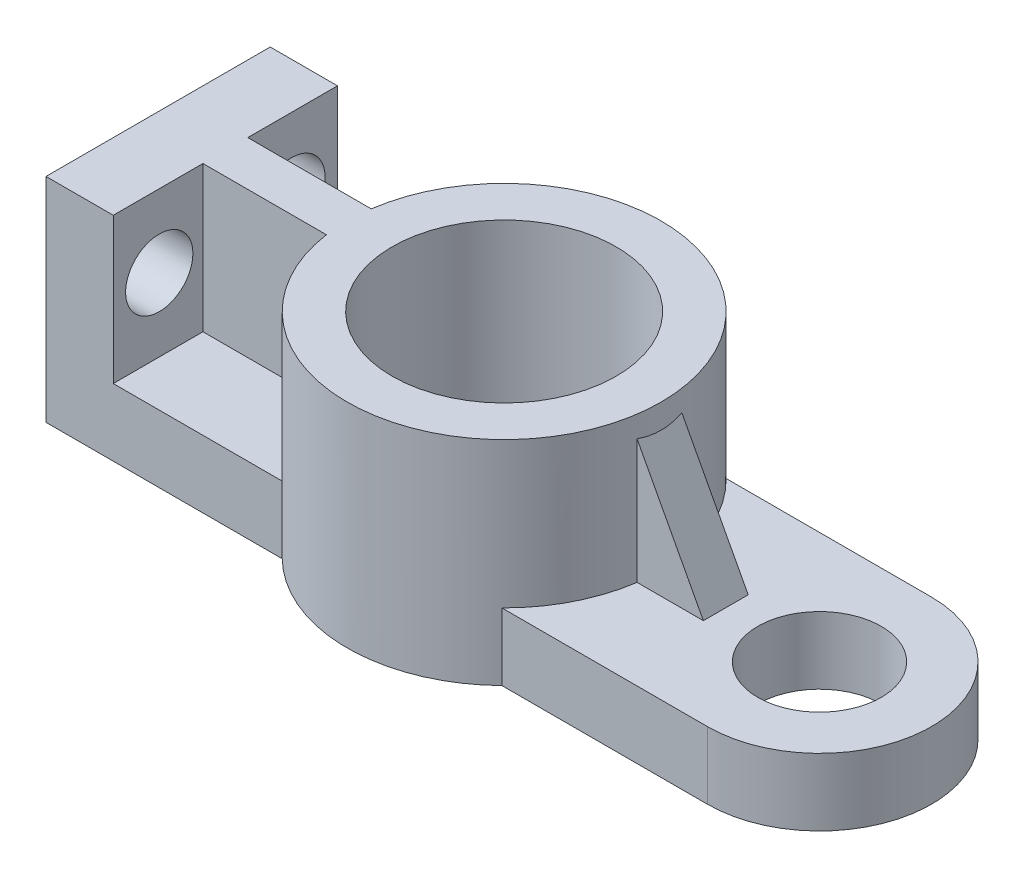
ISO-10303-21;
HEADER;
FILE_DESCRIPTION(('STEP AP214'),'2;1');
FILE_NAME('part.step','',(''),(''),'','','');
FILE_SCHEMA(('AUTOMOTIVE_DESIGN { 1 0 10303 214 1 1 1 1 }'));
ENDSEC;
DATA;
#1=APPLICATION_CONTEXT('core data for automotive mechanical design processes');
#2=APPLICATION_PROTOCOL_DEFINITION('international standard','automotive_design',2000,#1);
#3=PRODUCT_CONTEXT('',#1,'mechanical');
#4=PRODUCT('Part','Part','',(#3));
#5=PRODUCT_RELATED_PRODUCT_CATEGORY('part','',(#4));
#6=PRODUCT_DEFINITION_FORMATION('','',#4);
#7=PRODUCT_DEFINITION_CONTEXT('part definition',#1,'design');
#8=PRODUCT_DEFINITION('design','',#6,#7);
#9=PRODUCT_DEFINITION_SHAPE('','',#8);
#10=(LENGTH_UNIT() NAMED_UNIT(*) SI_UNIT(.MILLI.,.METRE.));
#11=(NAMED_UNIT(*) PLANE_ANGLE_UNIT() SI_UNIT($,.RADIAN.));
#12=(NAMED_UNIT(*) SI_UNIT($,.STERADIAN.) SOLID_ANGLE_UNIT());
#13=UNCERTAINTY_MEASURE_WITH_UNIT(LENGTH_MEASURE(1.E-05),#10,'distance_accuracy_value','');
#14=(GEOMETRIC_REPRESENTATION_CONTEXT(3) GLOBAL_UNCERTAINTY_ASSIGNED_CONTEXT((#13)) GLOBAL_UNIT_ASSIGNED_CONTEXT((#10,
#11,#12)) REPRESENTATION_CONTEXT('',''));
#15=CARTESIAN_POINT('',(0.,0.,0.));
#16=DIRECTION('',(0.,0.,1.));
#17=DIRECTION('',(1.,0.,0.));
#18=AXIS2_PLACEMENT_3D('',#15,#16,#17);
#19=CARTESIAN_POINT('',(0.,15.,100.));
#20=DIRECTION('',(0.,1.,0.));
#21=DIRECTION('',(0.,0.,1.));
#22=AXIS2_PLACEMENT_3D('',#19,#20,#21);
#23=PLANE('',#22);
#24=DIRECTION('',(0.,0.,-1.));
#25=VECTOR('',#24,1.);
#26=CARTESIAN_POINT('',(15.,15.,100.));
#27=LINE('',#26,#25);
#28=CARTESIAN_POINT('',(15.,15.,40.));
#29=VERTEX_POINT('',#28);
#30=CARTESIAN_POINT('',(15.,15.,0.));
#31=VERTEX_POINT('',#30);
#32=EDGE_CURVE('E342',#29,#31,#27,.T.);
#33=ORIENTED_EDGE('',*,*,#32,.F.);
#34=DIRECTION('',(1.,0.,0.));
#35=VECTOR('',#34,1.);
#36=CARTESIAN_POINT('',(0.,15.,40.));
#37=LINE('',#36,#35);
#38=CARTESIAN_POINT('',(70.0606311370799,15.,40.));
#39=VERTEX_POINT('',#38);
#40=EDGE_CURVE('E208',#29,#39,#37,.T.);
#41=ORIENTED_EDGE('',*,*,#40,.T.);
#42=CARTESIAN_POINT('',(139.342663439835,15.,50.));
#43=DIRECTION('',(0.,1.,0.));
#44=DIRECTION('',(0.,0.,1.));
#45=AXIS2_PLACEMENT_3D('',#42,#43,#44);
#46=CIRCLE('',#45,70.);
#47=CARTESIAN_POINT('',(90.3528685841714,15.,0.));
#48=VERTEX_POINT('',#47);
#49=EDGE_CURVE('E260',#48,#39,#46,.T.);
#50=ORIENTED_EDGE('',*,*,#49,.F.);
#51=DIRECTION('',(1.,0.,0.));
#52=VECTOR('',#51,1.);
#53=CARTESIAN_POINT('',(0.,15.,0.));
#54=LINE('',#53,#52);
#55=EDGE_CURVE('E316',#31,#48,#54,.T.);
#56=ORIENTED_EDGE('',*,*,#55,.F.);
#57=EDGE_LOOP('',(#33,#41,#50,#56));
#58=FACE_BOUND('',#57,.T.);
#59=ADVANCED_FACE('F45',(#58),#23,.T.);
#60=CARTESIAN_POINT('',(15.,80.,100.));
#61=DIRECTION('',(1.,0.,0.));
#62=DIRECTION('',(0.,0.,-1.));
#63=AXIS2_PLACEMENT_3D('',#60,#61,#62);
#64=PLANE('',#63);
#65=CARTESIAN_POINT('',(15.,47.5,20.5122660891121));
#66=DIRECTION('',(1.,0.,0.));
#67=DIRECTION('',(0.,0.,1.));
#68=AXIS2_PLACEMENT_3D('',#65,#66,#67);
#69=CIRCLE('',#68,15.);
#70=CARTESIAN_POINT('',(15.,47.5,35.5122660891121));
#71=VERTEX_POINT('',#70);
#72=EDGE_CURVE('E236',#71,#71,#69,.T.);
#73=ORIENTED_EDGE('',*,*,#72,.F.);
#74=EDGE_LOOP('',(#73));
#75=FACE_BOUND('',#74,.T.);
#76=DIRECTION('',(0.,0.,-1.));
#77=VECTOR('',#76,1.);
#78=CARTESIAN_POINT('',(15.,80.,100.));
#79=LINE('',#78,#77);
#80=CARTESIAN_POINT('',(15.,80.,40.));
#81=VERTEX_POINT('',#80);
#82=CARTESIAN_POINT('',(15.,80.,0.));
#83=VERTEX_POINT('',#82);
#84=EDGE_CURVE('E337',#81,#83,#79,.T.);
#85=ORIENTED_EDGE('',*,*,#84,.F.);
#86=DIRECTION('',(0.,-1.,0.));
#87=VECTOR('',#86,1.);
#88=CARTESIAN_POINT('',(15.,80.,40.));
#89=LINE('',#88,#87);
#90=EDGE_CURVE('E212',#81,#29,#89,.T.);
#91=ORIENTED_EDGE('',*,*,#90,.T.);
#92=ORIENTED_EDGE('',*,*,#32,.T.);
#93=DIRECTION('',(0.,1.,0.));
#94=VECTOR('',#93,1.);
#95=CARTESIAN_POINT('',(15.,80.,0.));
#96=LINE('',#95,#94);
#97=EDGE_CURVE('E320',#83,#31,#96,.F.);
#98=ORIENTED_EDGE('',*,*,#97,.F.);
#99=EDGE_LOOP('',(#85,#91,#92,#98));
#100=FACE_BOUND('',#99,.T.);
#101=ADVANCED_FACE('F369',(#75,#100),#64,.T.);
#102=DIRECTION('',(1.,0.,0.));
#103=VECTOR('',#102,1.);
#104=CARTESIAN_POINT('',(0.,15.,60.));
#105=LINE('',#104,#103);
#106=CARTESIAN_POINT('',(208.62469574259,15.,60.));
#107=VERTEX_POINT('',#106);
#108=CARTESIAN_POINT('',(238.197765894712,15.,60.));
#109=VERTEX_POINT('',#108);
#110=EDGE_CURVE('E189',#107,#109,#105,.T.);
#111=ORIENTED_EDGE('',*,*,#110,.F.);
#112=CARTESIAN_POINT('',(188.332458295499,15.,100.));
#113=VERTEX_POINT('',#112);
#114=EDGE_CURVE('E185',#113,#107,#46,.T.);
#115=ORIENTED_EDGE('',*,*,#114,.F.);
#116=DIRECTION('',(1.,0.,0.));
#117=VECTOR('',#116,1.);
#118=CARTESIAN_POINT('',(0.,15.,100.));
#119=LINE('',#118,#117);
#120=CARTESIAN_POINT('',(280.,15.,100.));
#121=VERTEX_POINT('',#120);
#122=EDGE_CURVE('E290',#113,#121,#119,.T.);
#123=ORIENTED_EDGE('',*,*,#122,.T.);
#124=CARTESIAN_POINT('',(280.,15.,50.));
#125=DIRECTION('',(0.,-1.,0.));
#126=DIRECTION('',(0.,0.,-1.));
#127=AXIS2_PLACEMENT_3D('',#124,#125,#126);
#128=CIRCLE('',#127,50.);
#129=CARTESIAN_POINT('',(280.,15.,0.));
#130=VERTEX_POINT('',#129);
#131=EDGE_CURVE('E274',#130,#121,#128,.T.);
#132=ORIENTED_EDGE('',*,*,#131,.F.);
#133=CARTESIAN_POINT('',(188.332458295499,15.,0.));
#134=VERTEX_POINT('',#133);
#135=EDGE_CURVE('E315',#134,#130,#54,.T.);
#136=ORIENTED_EDGE('',*,*,#135,.F.);
#137=CARTESIAN_POINT('',(208.62469574259,15.,40.));
#138=VERTEX_POINT('',#137);
#139=EDGE_CURVE('E259',#138,#134,#46,.T.);
#140=ORIENTED_EDGE('',*,*,#139,.F.);
#141=DIRECTION('',(1.,0.,0.));
#142=VECTOR('',#141,1.);
#143=CARTESIAN_POINT('',(0.,15.,40.));
#144=LINE('',#143,#142);
#145=CARTESIAN_POINT('',(238.197765894712,15.,40.));
#146=VERTEX_POINT('',#145);
#147=EDGE_CURVE('E61',#138,#146,#144,.T.);
#148=ORIENTED_EDGE('',*,*,#147,.T.);
#149=DIRECTION('',(0.,0.,1.));
#150=VECTOR('',#149,1.);
#151=CARTESIAN_POINT('',(238.197765894712,15.,100.));
#152=LINE('',#151,#150);
#153=EDGE_CURVE('E177',#109,#146,#152,.F.);
#154=ORIENTED_EDGE('',*,*,#153,.F.);
#155=EDGE_LOOP('',(#111,#115,#123,#132,#136,#140,#148,#154));
#156=FACE_BOUND('',#155,.T.);
#157=CARTESIAN_POINT('',(280.,15.,50.));
#158=DIRECTION('',(0.,1.,0.));
#159=DIRECTION('',(0.,0.,1.));
#160=AXIS2_PLACEMENT_3D('',#157,#158,#159);
#161=CIRCLE('',#160,27.5);
#162=CARTESIAN_POINT('',(280.,15.,77.5));
#163=VERTEX_POINT('',#162);
#164=EDGE_CURVE('E273',#163,#163,#161,.T.);
#165=ORIENTED_EDGE('',*,*,#164,.F.);
#166=EDGE_LOOP('',(#165));
#167=FACE_BOUND('',#166,.T.);
#168=ADVANCED_FACE('F388',(#156,#167),#23,.T.);
#169=CARTESIAN_POINT('',(0.,0.,100.));
#170=DIRECTION('',(0.,0.,-1.));
#171=DIRECTION('',(-1.,0.,0.));
#172=AXIS2_PLACEMENT_3D('',#169,#170,#171);
#173=PLANE('',#172);
#174=DIRECTION('',(1.,0.,0.));
#175=VECTOR('',#174,1.);
#176=CARTESIAN_POINT('',(0.,-15.,100.));
#177=LINE('',#176,#175);
#178=CARTESIAN_POINT('',(-15.,-15.,100.));
#179=VERTEX_POINT('',#178);
#180=CARTESIAN_POINT('',(90.3528685841714,-15.,100.));
#181=VERTEX_POINT('',#180);
#182=EDGE_CURVE('E281',#179,#181,#177,.T.);
#183=ORIENTED_EDGE('',*,*,#182,.T.);
#184=DIRECTION('',(0.,1.,0.));
#185=VECTOR('',#184,1.);
#186=CARTESIAN_POINT('',(90.3528685841714,-15.,100.));
#187=LINE('',#186,#185);
#188=CARTESIAN_POINT('',(90.3528685841714,15.,100.));
#189=VERTEX_POINT('',#188);
#190=EDGE_CURVE('E265',#181,#189,#187,.T.);
#191=ORIENTED_EDGE('',*,*,#190,.T.);
#192=CARTESIAN_POINT('',(15.,15.,100.));
#193=VERTEX_POINT('',#192);
#194=EDGE_CURVE('E291',#193,#189,#119,.T.);
#195=ORIENTED_EDGE('',*,*,#194,.F.);
#196=DIRECTION('',(0.,1.,0.));
#197=VECTOR('',#196,1.);
#198=CARTESIAN_POINT('',(15.,80.,100.));
#199=LINE('',#198,#197);
#200=CARTESIAN_POINT('',(15.,80.,100.));
#201=VERTEX_POINT('',#200);
#202=EDGE_CURVE('E295',#201,#193,#199,.F.);
#203=ORIENTED_EDGE('',*,*,#202,.F.);
#204=DIRECTION('',(1.,0.,0.));
#205=VECTOR('',#204,1.);
#206=CARTESIAN_POINT('',(-15.,80.,100.));
#207=LINE('',#206,#205);
#208=CARTESIAN_POINT('',(-15.,80.,100.));
#209=VERTEX_POINT('',#208);
#210=EDGE_CURVE('E299',#209,#201,#207,.T.);
#211=ORIENTED_EDGE('',*,*,#210,.F.);
#212=DIRECTION('',(0.,1.,0.));
#213=VECTOR('',#212,1.);
#214=CARTESIAN_POINT('',(-15.,80.,100.));
#215=LINE('',#214,#213);
#216=EDGE_CURVE('E303',#209,#179,#215,.F.);
#217=ORIENTED_EDGE('',*,*,#216,.T.);
#218=EDGE_LOOP('',(#183,#191,#195,#203,#211,#217));
#219=FACE_BOUND('',#218,.T.);
#220=ADVANCED_FACE('F426',(#219),#173,.F.);
#221=CARTESIAN_POINT('',(0.,0.,0.));
#222=DIRECTION('',(0.,0.,-1.));
#223=DIRECTION('',(-1.,0.,0.));
#224=AXIS2_PLACEMENT_3D('',#221,#222,#223);
#225=PLANE('',#224);
#226=DIRECTION('',(0.,1.,0.));
#227=VECTOR('',#226,1.);
#228=CARTESIAN_POINT('',(90.3528685841714,-15.,0.));
#229=LINE('',#228,#227);
#230=CARTESIAN_POINT('',(90.3528685841714,-15.,0.));
#231=VERTEX_POINT('',#230);
#232=EDGE_CURVE('E54',#231,#48,#229,.T.);
#233=ORIENTED_EDGE('',*,*,#232,.F.);
#234=DIRECTION('',(1.,0.,0.));
#235=VECTOR('',#234,1.);
#236=CARTESIAN_POINT('',(0.,-15.,0.));
#237=LINE('',#236,#235);
#238=CARTESIAN_POINT('',(-15.,-15.,0.));
#239=VERTEX_POINT('',#238);
#240=EDGE_CURVE('E307',#239,#231,#237,.T.);
#241=ORIENTED_EDGE('',*,*,#240,.F.);
#242=DIRECTION('',(0.,1.,0.));
#243=VECTOR('',#242,1.);
#244=CARTESIAN_POINT('',(-15.,80.,0.));
#245=LINE('',#244,#243);
#246=CARTESIAN_POINT('',(-15.,80.,0.));
#247=VERTEX_POINT('',#246);
#248=EDGE_CURVE('E328',#247,#239,#245,.F.);
#249=ORIENTED_EDGE('',*,*,#248,.F.);
#250=DIRECTION('',(1.,0.,0.));
#251=VECTOR('',#250,1.);
#252=CARTESIAN_POINT('',(-15.,80.,0.));
#253=LINE('',#252,#251);
#254=EDGE_CURVE('E324',#247,#83,#253,.T.);
#255=ORIENTED_EDGE('',*,*,#254,.T.);
#256=ORIENTED_EDGE('',*,*,#97,.T.);
#257=ORIENTED_EDGE('',*,*,#55,.T.);
#258=EDGE_LOOP('',(#233,#241,#249,#255,#256,#257));
#259=FACE_BOUND('',#258,.T.);
#260=ADVANCED_FACE('F363',(#259),#225,.T.);
#261=CARTESIAN_POINT('',(0.,-15.,100.));
#262=DIRECTION('',(0.,1.,0.));
#263=DIRECTION('',(0.,0.,1.));
#264=AXIS2_PLACEMENT_3D('',#261,#262,#263);
#265=PLANE('',#264);
#266=CARTESIAN_POINT('',(280.,-15.,50.));
#267=DIRECTION('',(0.,1.,0.));
#268=DIRECTION('',(0.,0.,1.));
#269=AXIS2_PLACEMENT_3D('',#266,#267,#268);
#270=CIRCLE('',#269,27.5);
#271=CARTESIAN_POINT('',(280.,-15.,77.5));
#272=VERTEX_POINT('',#271);
#273=EDGE_CURVE('E269',#272,#272,#270,.T.);
#274=ORIENTED_EDGE('',*,*,#273,.T.);
#275=EDGE_LOOP('',(#274));
#276=FACE_BOUND('',#275,.T.);
#277=CARTESIAN_POINT('',(139.342663439835,-15.,50.));
#278=DIRECTION('',(0.,1.,0.));
#279=DIRECTION('',(0.,0.,1.));
#280=AXIS2_PLACEMENT_3D('',#277,#278,#279);
#281=CIRCLE('',#280,50.);
#282=CARTESIAN_POINT('',(139.342663439835,-15.,100.));
#283=VERTEX_POINT('',#282);
#284=EDGE_CURVE('E243',#283,#283,#281,.T.);
#285=ORIENTED_EDGE('',*,*,#284,.T.);
#286=EDGE_LOOP('',(#285));
#287=FACE_BOUND('',#286,.T.);
#288=DIRECTION('',(0.,0.,-1.));
#289=VECTOR('',#288,1.);
#290=CARTESIAN_POINT('',(-15.,-15.,100.));
#291=LINE('',#290,#289);
#292=EDGE_CURVE('E306',#179,#239,#291,.T.);
#293=ORIENTED_EDGE('',*,*,#292,.T.);
#294=ORIENTED_EDGE('',*,*,#240,.T.);
#295=CARTESIAN_POINT('',(139.342663439835,-15.,50.));
#296=DIRECTION('',(0.,1.,0.));
#297=DIRECTION('',(0.,0.,1.));
#298=AXIS2_PLACEMENT_3D('',#295,#296,#297);
#299=CIRCLE('',#298,70.);
#300=CARTESIAN_POINT('',(188.332458295499,-15.,0.));
#301=VERTEX_POINT('',#300);
#302=EDGE_CURVE('E255',#301,#231,#299,.T.);
#303=ORIENTED_EDGE('',*,*,#302,.F.);
#304=CARTESIAN_POINT('',(280.,-15.,0.));
#305=VERTEX_POINT('',#304);
#306=EDGE_CURVE('E280',#301,#305,#237,.T.);
#307=ORIENTED_EDGE('',*,*,#306,.T.);
#308=CARTESIAN_POINT('',(280.,-15.,50.));
#309=DIRECTION('',(0.,-1.,0.));
#310=DIRECTION('',(0.,0.,-1.));
#311=AXIS2_PLACEMENT_3D('',#308,#309,#310);
#312=CIRCLE('',#311,50.);
#313=CARTESIAN_POINT('',(280.,-15.,100.));
#314=VERTEX_POINT('',#313);
#315=EDGE_CURVE('E277',#305,#314,#312,.T.);
#316=ORIENTED_EDGE('',*,*,#315,.T.);
#317=CARTESIAN_POINT('',(188.332458295499,-15.,100.));
#318=VERTEX_POINT('',#317);
#319=EDGE_CURVE('E286',#318,#314,#177,.T.);
#320=ORIENTED_EDGE('',*,*,#319,.F.);
#321=EDGE_CURVE('E252',#181,#318,#299,.T.);
#322=ORIENTED_EDGE('',*,*,#321,.F.);
#323=ORIENTED_EDGE('',*,*,#182,.F.);
#324=EDGE_LOOP('',(#293,#294,#303,#307,#316,#320,#322,#323));
#325=FACE_BOUND('',#324,.T.);
#326=ADVANCED_FACE('F47',(#276,#287,#325),#265,.F.);
#327=DIRECTION('',(1.,0.,0.));
#328=VECTOR('',#327,1.);
#329=CARTESIAN_POINT('',(0.,15.,60.));
#330=LINE('',#329,#328);
#331=CARTESIAN_POINT('',(15.,15.,60.));
#332=VERTEX_POINT('',#331);
#333=CARTESIAN_POINT('',(70.0606311370799,15.,60.));
#334=VERTEX_POINT('',#333);
#335=EDGE_CURVE('E220',#332,#334,#330,.T.);
#336=ORIENTED_EDGE('',*,*,#335,.F.);
#337=EDGE_CURVE('E343',#193,#332,#27,.T.);
#338=ORIENTED_EDGE('',*,*,#337,.F.);
#339=ORIENTED_EDGE('',*,*,#194,.T.);
#340=EDGE_CURVE('E264',#334,#189,#46,.T.);
#341=ORIENTED_EDGE('',*,*,#340,.F.);
#342=EDGE_LOOP('',(#336,#338,#339,#341));
#343=FACE_BOUND('',#342,.T.);
#344=ADVANCED_FACE('F417',(#343),#23,.T.);
#345=DIRECTION('',(0.,-1.,0.));
#346=VECTOR('',#345,1.);
#347=CARTESIAN_POINT('',(15.,80.,60.));
#348=LINE('',#347,#346);
#349=CARTESIAN_POINT('',(15.,80.,60.));
#350=VERTEX_POINT('',#349);
#351=EDGE_CURVE('E223',#350,#332,#348,.T.);
#352=ORIENTED_EDGE('',*,*,#351,.F.);
#353=EDGE_CURVE('E338',#201,#350,#79,.T.);
#354=ORIENTED_EDGE('',*,*,#353,.F.);
#355=ORIENTED_EDGE('',*,*,#202,.T.);
#356=ORIENTED_EDGE('',*,*,#337,.T.);
#357=EDGE_LOOP('',(#352,#354,#355,#356));
#358=FACE_BOUND('',#357,.T.);
#359=CARTESIAN_POINT('',(15.,47.5,79.4877339108879));
#360=DIRECTION('',(1.,0.,0.));
#361=DIRECTION('',(0.,0.,-1.));
#362=AXIS2_PLACEMENT_3D('',#359,#360,#361);
#363=CIRCLE('',#362,15.);
#364=CARTESIAN_POINT('',(15.,47.5,64.4877339108879));
#365=VERTEX_POINT('',#364);
#366=EDGE_CURVE('E232',#365,#365,#363,.T.);
#367=ORIENTED_EDGE('',*,*,#366,.F.);
#368=EDGE_LOOP('',(#367));
#369=FACE_BOUND('',#368,.T.);
#370=ADVANCED_FACE('F424',(#358,#369),#64,.T.);
#371=CARTESIAN_POINT('',(-15.,80.,100.));
#372=DIRECTION('',(0.,1.,0.));
#373=DIRECTION('',(0.,0.,1.));
#374=AXIS2_PLACEMENT_3D('',#371,#372,#373);
#375=PLANE('',#374);
#376=CARTESIAN_POINT('',(139.342663439835,80.,50.));
#377=DIRECTION('',(0.,1.,0.));
#378=DIRECTION('',(0.,0.,1.));
#379=AXIS2_PLACEMENT_3D('',#376,#377,#378);
#380=CIRCLE('',#379,50.);
#381=CARTESIAN_POINT('',(139.342663439835,80.,100.));
#382=VERTEX_POINT('',#381);
#383=EDGE_CURVE('E231',#382,#382,#380,.T.);
#384=ORIENTED_EDGE('',*,*,#383,.F.);
#385=EDGE_LOOP('',(#384));
#386=FACE_BOUND('',#385,.T.);
#387=DIRECTION('',(1.,0.,0.));
#388=VECTOR('',#387,1.);
#389=CARTESIAN_POINT('',(157.5,80.,60.));
#390=LINE('',#389,#388);
#391=CARTESIAN_POINT('',(70.0606311370799,80.,60.));
#392=VERTEX_POINT('',#391);
#393=EDGE_CURVE('E199',#350,#392,#390,.T.);
#394=ORIENTED_EDGE('',*,*,#393,.T.);
#395=CARTESIAN_POINT('',(139.342663439835,80.,50.));
#396=DIRECTION('',(0.,1.,0.));
#397=DIRECTION('',(0.,0.,1.));
#398=AXIS2_PLACEMENT_3D('',#395,#396,#397);
#399=CIRCLE('',#398,70.);
#400=CARTESIAN_POINT('',(70.0606311370799,80.,40.));
#401=VERTEX_POINT('',#400);
#402=EDGE_CURVE('E69',#392,#401,#399,.T.);
#403=ORIENTED_EDGE('',*,*,#402,.T.);
#404=DIRECTION('',(1.,0.,0.));
#405=VECTOR('',#404,1.);
#406=CARTESIAN_POINT('',(157.5,80.,40.));
#407=LINE('',#406,#405);
#408=EDGE_CURVE('E198',#81,#401,#407,.T.);
#409=ORIENTED_EDGE('',*,*,#408,.F.);
#410=ORIENTED_EDGE('',*,*,#84,.T.);
#411=ORIENTED_EDGE('',*,*,#254,.F.);
#412=DIRECTION('',(0.,0.,-1.));
#413=VECTOR('',#412,1.);
#414=CARTESIAN_POINT('',(-15.,80.,100.));
#415=LINE('',#414,#413);
#416=EDGE_CURVE('E334',#209,#247,#415,.T.);
#417=ORIENTED_EDGE('',*,*,#416,.F.);
#418=ORIENTED_EDGE('',*,*,#210,.T.);
#419=ORIENTED_EDGE('',*,*,#353,.T.);
#420=EDGE_LOOP('',(#394,#403,#409,#410,#411,#417,#418,#419));
#421=FACE_BOUND('',#420,.T.);
#422=ADVANCED_FACE('F432',(#386,#421),#375,.T.);
#423=CARTESIAN_POINT('',(-15.,80.,100.));
#424=DIRECTION('',(1.,0.,0.));
#425=DIRECTION('',(0.,0.,-1.));
#426=AXIS2_PLACEMENT_3D('',#423,#424,#425);
#427=PLANE('',#426);
#428=CARTESIAN_POINT('',(-15.,47.5,79.4877339108879));
#429=DIRECTION('',(1.,0.,0.));
#430=DIRECTION('',(0.,0.,-1.));
#431=AXIS2_PLACEMENT_3D('',#428,#429,#430);
#432=CIRCLE('',#431,15.);
#433=CARTESIAN_POINT('',(-15.,47.5,64.4877339108879));
#434=VERTEX_POINT('',#433);
#435=EDGE_CURVE('E227',#434,#434,#432,.T.);
#436=ORIENTED_EDGE('',*,*,#435,.T.);
#437=EDGE_LOOP('',(#436));
#438=FACE_BOUND('',#437,.T.);
#439=ORIENTED_EDGE('',*,*,#416,.T.);
#440=ORIENTED_EDGE('',*,*,#248,.T.);
#441=ORIENTED_EDGE('',*,*,#292,.F.);
#442=ORIENTED_EDGE('',*,*,#216,.F.);
#443=EDGE_LOOP('',(#439,#440,#441,#442));
#444=FACE_BOUND('',#443,.T.);
#445=CARTESIAN_POINT('',(-15.,47.5,20.5122660891121));
#446=DIRECTION('',(1.,0.,0.));
#447=DIRECTION('',(0.,0.,1.));
#448=AXIS2_PLACEMENT_3D('',#445,#446,#447);
#449=CIRCLE('',#448,15.);
#450=CARTESIAN_POINT('',(-15.,47.5,35.5122660891121));
#451=VERTEX_POINT('',#450);
#452=EDGE_CURVE('E226',#451,#451,#449,.T.);
#453=ORIENTED_EDGE('',*,*,#452,.T.);
#454=EDGE_LOOP('',(#453));
#455=FACE_BOUND('',#454,.T.);
#456=ADVANCED_FACE('F449',(#438,#444,#455),#427,.F.);
#457=ORIENTED_EDGE('',*,*,#122,.F.);
#458=DIRECTION('',(0.,1.,0.));
#459=VECTOR('',#458,1.);
#460=CARTESIAN_POINT('',(188.332458295499,-15.,100.));
#461=LINE('',#460,#459);
#462=EDGE_CURVE('E258',#113,#318,#461,.F.);
#463=ORIENTED_EDGE('',*,*,#462,.T.);
#464=ORIENTED_EDGE('',*,*,#319,.T.);
#465=DIRECTION('',(0.,-1.,0.));
#466=VECTOR('',#465,1.);
#467=CARTESIAN_POINT('',(280.,15.,100.));
#468=LINE('',#467,#466);
#469=EDGE_CURVE('E285',#121,#314,#468,.T.);
#470=ORIENTED_EDGE('',*,*,#469,.F.);
#471=EDGE_LOOP('',(#457,#463,#464,#470));
#472=FACE_BOUND('',#471,.T.);
#473=ADVANCED_FACE('F400',(#472),#173,.F.);
#474=DIRECTION('',(0.,1.,0.));
#475=VECTOR('',#474,1.);
#476=CARTESIAN_POINT('',(188.332458295499,-15.,0.));
#477=LINE('',#476,#475);
#478=EDGE_CURVE('E347',#134,#301,#477,.F.);
#479=ORIENTED_EDGE('',*,*,#478,.F.);
#480=ORIENTED_EDGE('',*,*,#135,.T.);
#481=DIRECTION('',(0.,-1.,0.));
#482=VECTOR('',#481,1.);
#483=CARTESIAN_POINT('',(280.,15.,0.));
#484=LINE('',#483,#482);
#485=EDGE_CURVE('E311',#130,#305,#484,.T.);
#486=ORIENTED_EDGE('',*,*,#485,.T.);
#487=ORIENTED_EDGE('',*,*,#306,.F.);
#488=EDGE_LOOP('',(#479,#480,#486,#487));
#489=FACE_BOUND('',#488,.T.);
#490=ADVANCED_FACE('F386',(#489),#225,.T.);
#491=CARTESIAN_POINT('',(280.,15.,50.));
#492=DIRECTION('',(0.,-1.,0.));
#493=DIRECTION('',(0.,0.,-1.));
#494=AXIS2_PLACEMENT_3D('',#491,#492,#493);
#495=CYLINDRICAL_SURFACE('',#494,50.);
#496=ORIENTED_EDGE('',*,*,#469,.T.);
#497=ORIENTED_EDGE('',*,*,#315,.F.);
#498=ORIENTED_EDGE('',*,*,#485,.F.);
#499=ORIENTED_EDGE('',*,*,#131,.T.);
#500=EDGE_LOOP('',(#496,#497,#498,#499));
#501=FACE_BOUND('',#500,.T.);
#502=ADVANCED_FACE('F395',(#501),#495,.T.);
#503=CARTESIAN_POINT('',(280.,-15.,50.));
#504=DIRECTION('',(0.,1.,0.));
#505=DIRECTION('',(0.,0.,1.));
#506=AXIS2_PLACEMENT_3D('',#503,#504,#505);
#507=CYLINDRICAL_SURFACE('',#506,27.5);
#508=ORIENTED_EDGE('',*,*,#273,.F.);
#509=EDGE_LOOP('',(#508));
#510=FACE_BOUND('',#509,.T.);
#511=ORIENTED_EDGE('',*,*,#164,.T.);
#512=EDGE_LOOP('',(#511));
#513=FACE_BOUND('',#512,.T.);
#514=ADVANCED_FACE('F472',(#510,#513),#507,.F.);
#515=CARTESIAN_POINT('',(139.342663439835,-15.,50.));
#516=DIRECTION('',(0.,1.,0.));
#517=DIRECTION('',(0.,0.,1.));
#518=AXIS2_PLACEMENT_3D('',#515,#516,#517);
#519=CYLINDRICAL_SURFACE('',#518,70.);
#520=DIRECTION('',(0.,1.,0.));
#521=VECTOR('',#520,1.);
#522=CARTESIAN_POINT('',(208.62469574259,-15.,60.));
#523=LINE('',#522,#521);
#524=CARTESIAN_POINT('',(208.62469574259,70.4626293048027,60.));
#525=VERTEX_POINT('',#524);
#526=EDGE_CURVE('E183',#525,#107,#523,.F.);
#527=ORIENTED_EDGE('',*,*,#526,.F.);
#528=CARTESIAN_POINT('',(139.342663439835,200.397183117619,50.));
#529=DIRECTION('',(-0.882399172067901,-0.470501542116371,0.));
#530=DIRECTION('',(-0.470501542116371,0.882399172067901,0.));
#531=AXIS2_PLACEMENT_3D('',#528,#529,#530);
#532=ELLIPSE('',#531,148.777408220878,70.);
#533=CARTESIAN_POINT('',(208.62469574259,70.4626293048027,40.));
#534=VERTEX_POINT('',#533);
#535=EDGE_CURVE('E11',#534,#525,#532,.T.);
#536=ORIENTED_EDGE('',*,*,#535,.F.);
#537=DIRECTION('',(0.,1.,0.));
#538=VECTOR('',#537,1.);
#539=CARTESIAN_POINT('',(208.62469574259,-15.,40.));
#540=LINE('',#539,#538);
#541=EDGE_CURVE('E163',#534,#138,#540,.F.);
#542=ORIENTED_EDGE('',*,*,#541,.T.);
#543=ORIENTED_EDGE('',*,*,#139,.T.);
#544=ORIENTED_EDGE('',*,*,#478,.T.);
#545=ORIENTED_EDGE('',*,*,#302,.T.);
#546=ORIENTED_EDGE('',*,*,#232,.T.);
#547=ORIENTED_EDGE('',*,*,#49,.T.);
#548=DIRECTION('',(0.,1.,0.));
#549=VECTOR('',#548,1.);
#550=CARTESIAN_POINT('',(70.0606311370799,-15.,40.));
#551=LINE('',#550,#549);
#552=EDGE_CURVE('E202',#39,#401,#551,.T.);
#553=ORIENTED_EDGE('',*,*,#552,.T.);
#554=ORIENTED_EDGE('',*,*,#402,.F.);
#555=DIRECTION('',(0.,1.,0.));
#556=VECTOR('',#555,1.);
#557=CARTESIAN_POINT('',(70.0606311370799,-15.,60.));
#558=LINE('',#557,#556);
#559=EDGE_CURVE('E216',#334,#392,#558,.T.);
#560=ORIENTED_EDGE('',*,*,#559,.F.);
#561=ORIENTED_EDGE('',*,*,#340,.T.);
#562=ORIENTED_EDGE('',*,*,#190,.F.);
#563=ORIENTED_EDGE('',*,*,#321,.T.);
#564=ORIENTED_EDGE('',*,*,#462,.F.);
#565=ORIENTED_EDGE('',*,*,#114,.T.);
#566=EDGE_LOOP('',(#527,#536,#542,#543,#544,#545,#546,#547,#553,#554,#560,#561,#562,#563,#564,#565));
#567=FACE_BOUND('',#566,.T.);
#568=ADVANCED_FACE('F181',(#567),#519,.T.);
#569=CARTESIAN_POINT('',(139.342663439835,-15.,50.));
#570=DIRECTION('',(0.,1.,0.));
#571=DIRECTION('',(0.,0.,1.));
#572=AXIS2_PLACEMENT_3D('',#569,#570,#571);
#573=CYLINDRICAL_SURFACE('',#572,50.);
#574=ORIENTED_EDGE('',*,*,#284,.F.);
#575=EDGE_LOOP('',(#574));
#576=FACE_BOUND('',#575,.T.);
#577=ORIENTED_EDGE('',*,*,#383,.T.);
#578=EDGE_LOOP('',(#577));
#579=FACE_BOUND('',#578,.T.);
#580=ADVANCED_FACE('F466',(#576,#579),#573,.F.);
#581=CARTESIAN_POINT('',(-15.,47.5,20.5122660891121));
#582=DIRECTION('',(1.,0.,0.));
#583=DIRECTION('',(0.,0.,-1.));
#584=AXIS2_PLACEMENT_3D('',#581,#582,#583);
#585=CYLINDRICAL_SURFACE('',#584,15.);
#586=ORIENTED_EDGE('',*,*,#452,.F.);
#587=EDGE_LOOP('',(#586));
#588=FACE_BOUND('',#587,.T.);
#589=ORIENTED_EDGE('',*,*,#72,.T.);
#590=EDGE_LOOP('',(#589));
#591=FACE_BOUND('',#590,.T.);
#592=ADVANCED_FACE('F459',(#588,#591),#585,.F.);
#593=CARTESIAN_POINT('',(-15.,47.5,79.4877339108879));
#594=DIRECTION('',(1.,0.,0.));
#595=DIRECTION('',(0.,0.,-1.));
#596=AXIS2_PLACEMENT_3D('',#593,#594,#595);
#597=CYLINDRICAL_SURFACE('',#596,15.);
#598=ORIENTED_EDGE('',*,*,#435,.F.);
#599=EDGE_LOOP('',(#598));
#600=FACE_BOUND('',#599,.T.);
#601=ORIENTED_EDGE('',*,*,#366,.T.);
#602=EDGE_LOOP('',(#601));
#603=FACE_BOUND('',#602,.T.);
#604=ADVANCED_FACE('F454',(#600,#603),#597,.F.);
#605=CARTESIAN_POINT('',(157.5,32.5,60.));
#606=DIRECTION('',(0.,0.,1.));
#607=DIRECTION('',(1.,0.,0.));
#608=AXIS2_PLACEMENT_3D('',#605,#606,#607);
#609=PLANE('',#608);
#610=ORIENTED_EDGE('',*,*,#393,.F.);
#611=ORIENTED_EDGE('',*,*,#351,.T.);
#612=ORIENTED_EDGE('',*,*,#335,.T.);
#613=ORIENTED_EDGE('',*,*,#559,.T.);
#614=EDGE_LOOP('',(#610,#611,#612,#613));
#615=FACE_BOUND('',#614,.T.);
#616=ADVANCED_FACE('F413',(#615),#609,.T.);
#617=CARTESIAN_POINT('',(157.5,32.5,40.));
#618=DIRECTION('',(0.,0.,1.));
#619=DIRECTION('',(1.,0.,0.));
#620=AXIS2_PLACEMENT_3D('',#617,#618,#619);
#621=PLANE('',#620);
#622=ORIENTED_EDGE('',*,*,#90,.F.);
#623=ORIENTED_EDGE('',*,*,#408,.T.);
#624=ORIENTED_EDGE('',*,*,#552,.F.);
#625=ORIENTED_EDGE('',*,*,#40,.F.);
#626=EDGE_LOOP('',(#622,#623,#624,#625));
#627=FACE_BOUND('',#626,.T.);
#628=ADVANCED_FACE('F405',(#627),#621,.F.);
#629=CARTESIAN_POINT('',(157.5,32.5,60.));
#630=DIRECTION('',(0.,0.,1.));
#631=DIRECTION('',(1.,0.,0.));
#632=AXIS2_PLACEMENT_3D('',#629,#630,#631);
#633=PLANE('',#632);
#634=ORIENTED_EDGE('',*,*,#526,.T.);
#635=ORIENTED_EDGE('',*,*,#110,.T.);
#636=DIRECTION('',(0.470501542116371,-0.882399172067901,0.));
#637=VECTOR('',#636,1.);
#638=CARTESIAN_POINT('',(203.539301556068,80.,60.));
#639=LINE('',#638,#637);
#640=EDGE_CURVE('E170',#525,#109,#639,.T.);
#641=ORIENTED_EDGE('',*,*,#640,.F.);
#642=EDGE_LOOP('',(#634,#635,#641));
#643=FACE_BOUND('',#642,.T.);
#644=ADVANCED_FACE('F401',(#643),#633,.T.);
#645=CARTESIAN_POINT('',(157.5,32.5,40.));
#646=DIRECTION('',(0.,0.,1.));
#647=DIRECTION('',(1.,0.,0.));
#648=AXIS2_PLACEMENT_3D('',#645,#646,#647);
#649=PLANE('',#648);
#650=ORIENTED_EDGE('',*,*,#147,.F.);
#651=ORIENTED_EDGE('',*,*,#541,.F.);
#652=DIRECTION('',(0.470501542116371,-0.882399172067901,0.));
#653=VECTOR('',#652,1.);
#654=CARTESIAN_POINT('',(203.539301556068,80.,40.));
#655=LINE('',#654,#653);
#656=EDGE_CURVE('E166',#534,#146,#655,.T.);
#657=ORIENTED_EDGE('',*,*,#656,.T.);
#658=EDGE_LOOP('',(#650,#651,#657));
#659=FACE_BOUND('',#658,.T.);
#660=ADVANCED_FACE('F165',(#659),#649,.F.);
#661=CARTESIAN_POINT('',(203.539301556068,80.,50.));
#662=DIRECTION('',(-0.882399172067901,-0.470501542116371,0.));
#663=DIRECTION('',(0.470501542116371,-0.882399172067901,0.));
#664=AXIS2_PLACEMENT_3D('',#661,#662,#663);
#665=PLANE('',#664);
#666=ORIENTED_EDGE('',*,*,#640,.T.);
#667=ORIENTED_EDGE('',*,*,#153,.T.);
#668=ORIENTED_EDGE('',*,*,#656,.F.);
#669=ORIENTED_EDGE('',*,*,#535,.T.);
#670=EDGE_LOOP('',(#666,#667,#668,#669));
#671=FACE_BOUND('',#670,.T.);
#672=ADVANCED_FACE('F174',(#671),#665,.F.);
#673=CLOSED_SHELL('',(#59,#101,#168,#220,#260,#326,#344,#370,#422,#456,#473,#490,#502,#514,#568,
#580,#592,#604,#616,#628,#644,#660,#672));
#674=MANIFOLD_SOLID_BREP('B2',#673);
#675=ADVANCED_BREP_SHAPE_REPRESENTATION('',(#18,#674),#14);
#676=SHAPE_DEFINITION_REPRESENTATION(#9,#675);
ENDSEC;
END-ISO-10303-21;
